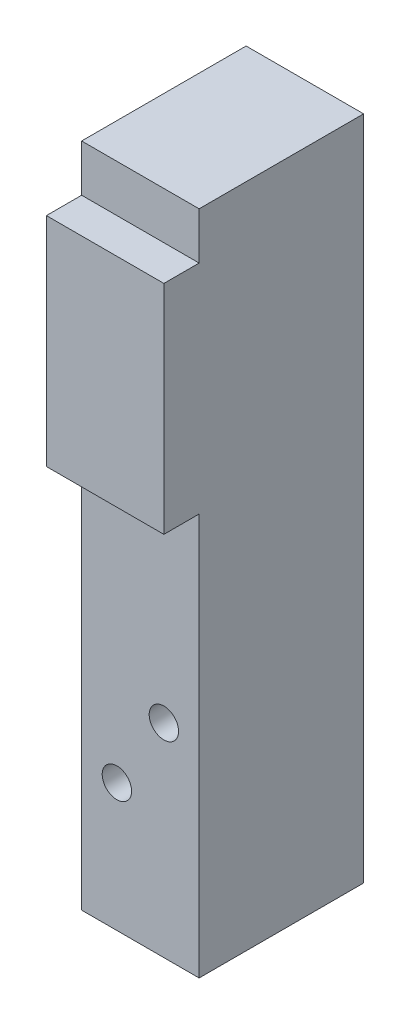
ISO-10303-21;
HEADER;
FILE_DESCRIPTION(('STEP AP214'),'2;1');
FILE_NAME('part.step','',(''),(''),'','','');
FILE_SCHEMA(('AUTOMOTIVE_DESIGN { 1 0 10303 214 1 1 1 1 }'));
ENDSEC;
DATA;
#1=APPLICATION_CONTEXT('core data for automotive mechanical design processes');
#2=APPLICATION_PROTOCOL_DEFINITION('international standard','automotive_design',2000,#1);
#3=PRODUCT_CONTEXT('',#1,'mechanical');
#4=PRODUCT('Part','Part','',(#3));
#5=PRODUCT_RELATED_PRODUCT_CATEGORY('part','',(#4));
#6=PRODUCT_DEFINITION_FORMATION('','',#4);
#7=PRODUCT_DEFINITION_CONTEXT('part definition',#1,'design');
#8=PRODUCT_DEFINITION('design','',#6,#7);
#9=PRODUCT_DEFINITION_SHAPE('','',#8);
#10=(LENGTH_UNIT() NAMED_UNIT(*) SI_UNIT(.MILLI.,.METRE.));
#11=(NAMED_UNIT(*) PLANE_ANGLE_UNIT() SI_UNIT($,.RADIAN.));
#12=(NAMED_UNIT(*) SI_UNIT($,.STERADIAN.) SOLID_ANGLE_UNIT());
#13=UNCERTAINTY_MEASURE_WITH_UNIT(LENGTH_MEASURE(1.E-05),#10,'distance_accuracy_value','');
#14=(GEOMETRIC_REPRESENTATION_CONTEXT(3) GLOBAL_UNCERTAINTY_ASSIGNED_CONTEXT((#13)) GLOBAL_UNIT_ASSIGNED_CONTEXT((#10,
#11,#12)) REPRESENTATION_CONTEXT('',''));
#15=CARTESIAN_POINT('',(0.,0.,0.));
#16=DIRECTION('',(0.,0.,1.));
#17=DIRECTION('',(1.,0.,0.));
#18=AXIS2_PLACEMENT_3D('',#15,#16,#17);
#19=CARTESIAN_POINT('',(-5.,-56.7,7.));
#20=DIRECTION('',(0.,0.,1.));
#21=DIRECTION('',(1.,0.,0.));
#22=AXIS2_PLACEMENT_3D('',#19,#20,#21);
#23=PLANE('',#22);
#24=DIRECTION('',(-1.,0.,0.));
#25=VECTOR('',#24,1.);
#26=CARTESIAN_POINT('',(-5.,-4.,7.));
#27=LINE('',#26,#25);
#28=CARTESIAN_POINT('',(5.,-4.00000000000003,7.));
#29=VERTEX_POINT('',#28);
#30=CARTESIAN_POINT('',(-5.,-4.00000000000003,7.));
#31=VERTEX_POINT('',#30);
#32=EDGE_CURVE('E50',#29,#31,#27,.T.);
#33=ORIENTED_EDGE('',*,*,#32,.F.);
#34=DIRECTION('',(0.,1.,0.));
#35=VECTOR('',#34,1.);
#36=CARTESIAN_POINT('',(5.,-56.7,7.));
#37=LINE('',#36,#35);
#38=CARTESIAN_POINT('',(5.,0.,7.));
#39=VERTEX_POINT('',#38);
#40=EDGE_CURVE('E157',#29,#39,#37,.T.);
#41=ORIENTED_EDGE('',*,*,#40,.T.);
#42=DIRECTION('',(1.,0.,0.));
#43=VECTOR('',#42,1.);
#44=CARTESIAN_POINT('',(-5.,0.,7.));
#45=LINE('',#44,#43);
#46=CARTESIAN_POINT('',(-5.,0.,7.));
#47=VERTEX_POINT('',#46);
#48=EDGE_CURVE('E222',#47,#39,#45,.T.);
#49=ORIENTED_EDGE('',*,*,#48,.F.);
#50=DIRECTION('',(0.,1.,0.));
#51=VECTOR('',#50,1.);
#52=CARTESIAN_POINT('',(-5.,-56.7,7.));
#53=LINE('',#52,#51);
#54=EDGE_CURVE('E55',#31,#47,#53,.T.);
#55=ORIENTED_EDGE('',*,*,#54,.F.);
#56=EDGE_LOOP('',(#33,#41,#49,#55));
#57=FACE_BOUND('',#56,.T.);
#58=ADVANCED_FACE('F33',(#57),#23,.T.);
#59=CARTESIAN_POINT('',(-5.,-56.7,7.));
#60=DIRECTION('',(-1.,0.,0.));
#61=DIRECTION('',(0.,0.,1.));
#62=AXIS2_PLACEMENT_3D('',#59,#60,#61);
#63=PLANE('',#62);
#64=DIRECTION('',(0.,0.,1.));
#65=VECTOR('',#64,1.);
#66=CARTESIAN_POINT('',(-5.,0.,7.));
#67=LINE('',#66,#65);
#68=CARTESIAN_POINT('',(-5.,0.,-7.));
#69=VERTEX_POINT('',#68);
#70=EDGE_CURVE('E169',#69,#47,#67,.T.);
#71=ORIENTED_EDGE('',*,*,#70,.F.);
#72=DIRECTION('',(0.,1.,0.));
#73=VECTOR('',#72,1.);
#74=CARTESIAN_POINT('',(-5.,-56.7,-7.));
#75=LINE('',#74,#73);
#76=CARTESIAN_POINT('',(-5.,-56.7,-7.));
#77=VERTEX_POINT('',#76);
#78=EDGE_CURVE('E11',#77,#69,#75,.T.);
#79=ORIENTED_EDGE('',*,*,#78,.F.);
#80=DIRECTION('',(0.,0.,1.));
#81=VECTOR('',#80,1.);
#82=CARTESIAN_POINT('',(-5.,-56.7,7.));
#83=LINE('',#82,#81);
#84=CARTESIAN_POINT('',(-5.,-56.7,7.));
#85=VERTEX_POINT('',#84);
#86=EDGE_CURVE('E216',#77,#85,#83,.T.);
#87=ORIENTED_EDGE('',*,*,#86,.T.);
#88=CARTESIAN_POINT('',(-5.,-22.498,7.));
#89=VERTEX_POINT('',#88);
#90=EDGE_CURVE('E194',#85,#89,#53,.T.);
#91=ORIENTED_EDGE('',*,*,#90,.T.);
#92=DIRECTION('',(0.,0.,-1.));
#93=VECTOR('',#92,1.);
#94=CARTESIAN_POINT('',(-5.,-22.498,10.));
#95=LINE('',#94,#93);
#96=CARTESIAN_POINT('',(-5.,-22.498,10.));
#97=VERTEX_POINT('',#96);
#98=EDGE_CURVE('E163',#97,#89,#95,.T.);
#99=ORIENTED_EDGE('',*,*,#98,.F.);
#100=DIRECTION('',(0.,-1.,0.));
#101=VECTOR('',#100,1.);
#102=CARTESIAN_POINT('',(-5.,-4.,10.));
#103=LINE('',#102,#101);
#104=CARTESIAN_POINT('',(-5.,-4.,10.));
#105=VERTEX_POINT('',#104);
#106=EDGE_CURVE('E173',#105,#97,#103,.T.);
#107=ORIENTED_EDGE('',*,*,#106,.F.);
#108=DIRECTION('',(0.,0.,-1.));
#109=VECTOR('',#108,1.);
#110=CARTESIAN_POINT('',(-5.,-4.,10.));
#111=LINE('',#110,#109);
#112=EDGE_CURVE('E174',#105,#31,#111,.T.);
#113=ORIENTED_EDGE('',*,*,#112,.T.);
#114=ORIENTED_EDGE('',*,*,#54,.T.);
#115=EDGE_LOOP('',(#71,#79,#87,#91,#99,#107,#113,#114));
#116=FACE_BOUND('',#115,.T.);
#117=ADVANCED_FACE('F35',(#116),#63,.T.);
#118=CARTESIAN_POINT('',(-5.,-56.7,-7.));
#119=DIRECTION('',(0.,0.,-1.));
#120=DIRECTION('',(-1.,0.,0.));
#121=AXIS2_PLACEMENT_3D('',#118,#119,#120);
#122=PLANE('',#121);
#123=CARTESIAN_POINT('',(0.,-36.2,-7.));
#124=DIRECTION('',(0.,0.,-1.));
#125=DIRECTION('',(-1.,0.,0.));
#126=AXIS2_PLACEMENT_3D('',#123,#124,#125);
#127=CIRCLE('',#126,1.25);
#128=CARTESIAN_POINT('',(-1.25,-36.2,-7.));
#129=VERTEX_POINT('',#128);
#130=EDGE_CURVE('E133',#129,#129,#127,.T.);
#131=ORIENTED_EDGE('',*,*,#130,.F.);
#132=EDGE_LOOP('',(#131));
#133=FACE_BOUND('',#132,.T.);
#134=CARTESIAN_POINT('',(0.,-42.6,-7.));
#135=DIRECTION('',(0.,0.,-1.));
#136=DIRECTION('',(-1.,0.,0.));
#137=AXIS2_PLACEMENT_3D('',#134,#135,#136);
#138=CIRCLE('',#137,1.25);
#139=CARTESIAN_POINT('',(-1.25,-42.6,-7.));
#140=VERTEX_POINT('',#139);
#141=EDGE_CURVE('E139',#140,#140,#138,.T.);
#142=ORIENTED_EDGE('',*,*,#141,.F.);
#143=EDGE_LOOP('',(#142));
#144=FACE_BOUND('',#143,.T.);
#145=CARTESIAN_POINT('',(0.,-49.,-7.));
#146=DIRECTION('',(0.,0.,-1.));
#147=DIRECTION('',(-1.,0.,0.));
#148=AXIS2_PLACEMENT_3D('',#145,#146,#147);
#149=CIRCLE('',#148,1.25);
#150=CARTESIAN_POINT('',(-1.25,-49.,-7.));
#151=VERTEX_POINT('',#150);
#152=EDGE_CURVE('E145',#151,#151,#149,.T.);
#153=ORIENTED_EDGE('',*,*,#152,.F.);
#154=EDGE_LOOP('',(#153));
#155=FACE_BOUND('',#154,.T.);
#156=DIRECTION('',(-1.,0.,0.));
#157=VECTOR('',#156,1.);
#158=CARTESIAN_POINT('',(-5.,0.,-7.));
#159=LINE('',#158,#157);
#160=CARTESIAN_POINT('',(5.,0.,-7.));
#161=VERTEX_POINT('',#160);
#162=EDGE_CURVE('E218',#161,#69,#159,.T.);
#163=ORIENTED_EDGE('',*,*,#162,.F.);
#164=DIRECTION('',(0.,1.,0.));
#165=VECTOR('',#164,1.);
#166=CARTESIAN_POINT('',(5.,-56.7,-7.));
#167=LINE('',#166,#165);
#168=CARTESIAN_POINT('',(5.,-56.7,-7.));
#169=VERTEX_POINT('',#168);
#170=EDGE_CURVE('E42',#169,#161,#167,.T.);
#171=ORIENTED_EDGE('',*,*,#170,.F.);
#172=DIRECTION('',(-1.,0.,0.));
#173=VECTOR('',#172,1.);
#174=CARTESIAN_POINT('',(-5.,-56.7,-7.));
#175=LINE('',#174,#173);
#176=EDGE_CURVE('E200',#169,#77,#175,.T.);
#177=ORIENTED_EDGE('',*,*,#176,.T.);
#178=ORIENTED_EDGE('',*,*,#78,.T.);
#179=EDGE_LOOP('',(#163,#171,#177,#178));
#180=FACE_BOUND('',#179,.T.);
#181=ADVANCED_FACE('F255',(#133,#144,#155,#180),#122,.T.);
#182=CARTESIAN_POINT('',(5.,-56.7,7.));
#183=DIRECTION('',(1.,0.,0.));
#184=DIRECTION('',(0.,0.,-1.));
#185=AXIS2_PLACEMENT_3D('',#182,#183,#184);
#186=PLANE('',#185);
#187=DIRECTION('',(0.,0.,-1.));
#188=VECTOR('',#187,1.);
#189=CARTESIAN_POINT('',(5.,0.,7.));
#190=LINE('',#189,#188);
#191=EDGE_CURVE('E191',#39,#161,#190,.T.);
#192=ORIENTED_EDGE('',*,*,#191,.F.);
#193=ORIENTED_EDGE('',*,*,#40,.F.);
#194=DIRECTION('',(0.,0.,-1.));
#195=VECTOR('',#194,1.);
#196=CARTESIAN_POINT('',(5.,-4.,10.));
#197=LINE('',#196,#195);
#198=CARTESIAN_POINT('',(5.,-4.,10.));
#199=VERTEX_POINT('',#198);
#200=EDGE_CURVE('E164',#199,#29,#197,.T.);
#201=ORIENTED_EDGE('',*,*,#200,.F.);
#202=DIRECTION('',(0.,1.,0.));
#203=VECTOR('',#202,1.);
#204=CARTESIAN_POINT('',(5.,-4.,10.));
#205=LINE('',#204,#203);
#206=CARTESIAN_POINT('',(5.,-22.498,10.));
#207=VERTEX_POINT('',#206);
#208=EDGE_CURVE('E189',#207,#199,#205,.T.);
#209=ORIENTED_EDGE('',*,*,#208,.F.);
#210=DIRECTION('',(0.,0.,-1.));
#211=VECTOR('',#210,1.);
#212=CARTESIAN_POINT('',(5.,-22.498,10.));
#213=LINE('',#212,#211);
#214=CARTESIAN_POINT('',(5.,-22.498,7.));
#215=VERTEX_POINT('',#214);
#216=EDGE_CURVE('E160',#207,#215,#213,.T.);
#217=ORIENTED_EDGE('',*,*,#216,.T.);
#218=CARTESIAN_POINT('',(5.,-56.7,7.));
#219=VERTEX_POINT('',#218);
#220=EDGE_CURVE('E193',#219,#215,#37,.T.);
#221=ORIENTED_EDGE('',*,*,#220,.F.);
#222=DIRECTION('',(0.,0.,-1.));
#223=VECTOR('',#222,1.);
#224=CARTESIAN_POINT('',(5.,-56.7,7.));
#225=LINE('',#224,#223);
#226=EDGE_CURVE('E210',#219,#169,#225,.T.);
#227=ORIENTED_EDGE('',*,*,#226,.T.);
#228=ORIENTED_EDGE('',*,*,#170,.T.);
#229=EDGE_LOOP('',(#192,#193,#201,#209,#217,#221,#227,#228));
#230=FACE_BOUND('',#229,.T.);
#231=ADVANCED_FACE('F188',(#230),#186,.T.);
#232=CARTESIAN_POINT('',(2.,-39.4,7.));
#233=DIRECTION('',(0.,0.,1.));
#234=DIRECTION('',(1.,0.,0.));
#235=AXIS2_PLACEMENT_3D('',#232,#233,#234);
#236=CIRCLE('',#235,1.24999999999999);
#237=CARTESIAN_POINT('',(3.24999999999999,-39.4,7.));
#238=VERTEX_POINT('',#237);
#239=EDGE_CURVE('E119',#238,#238,#236,.T.);
#240=ORIENTED_EDGE('',*,*,#239,.F.);
#241=EDGE_LOOP('',(#240));
#242=FACE_BOUND('',#241,.T.);
#243=CARTESIAN_POINT('',(-2.,-45.81,7.));
#244=DIRECTION('',(0.,0.,1.));
#245=DIRECTION('',(1.,0.,0.));
#246=AXIS2_PLACEMENT_3D('',#243,#244,#245);
#247=CIRCLE('',#246,1.24999999999999);
#248=CARTESIAN_POINT('',(-0.750000000000011,-45.81,7.));
#249=VERTEX_POINT('',#248);
#250=EDGE_CURVE('E127',#249,#249,#247,.T.);
#251=ORIENTED_EDGE('',*,*,#250,.F.);
#252=EDGE_LOOP('',(#251));
#253=FACE_BOUND('',#252,.T.);
#254=DIRECTION('',(1.,0.,0.));
#255=VECTOR('',#254,1.);
#256=CARTESIAN_POINT('',(-5.,-22.498,7.));
#257=LINE('',#256,#255);
#258=EDGE_CURVE('E148',#89,#215,#257,.T.);
#259=ORIENTED_EDGE('',*,*,#258,.F.);
#260=ORIENTED_EDGE('',*,*,#90,.F.);
#261=DIRECTION('',(1.,0.,0.));
#262=VECTOR('',#261,1.);
#263=CARTESIAN_POINT('',(-5.,-56.7,7.));
#264=LINE('',#263,#262);
#265=EDGE_CURVE('E213',#85,#219,#264,.T.);
#266=ORIENTED_EDGE('',*,*,#265,.T.);
#267=ORIENTED_EDGE('',*,*,#220,.T.);
#268=EDGE_LOOP('',(#259,#260,#266,#267));
#269=FACE_BOUND('',#268,.T.);
#270=ADVANCED_FACE('F244',(#242,#253,#269),#23,.T.);
#271=CARTESIAN_POINT('',(-5.,-56.7,7.));
#272=DIRECTION('',(0.,-1.,0.));
#273=DIRECTION('',(0.,0.,-1.));
#274=AXIS2_PLACEMENT_3D('',#271,#272,#273);
#275=PLANE('',#274);
#276=ORIENTED_EDGE('',*,*,#86,.F.);
#277=ORIENTED_EDGE('',*,*,#176,.F.);
#278=ORIENTED_EDGE('',*,*,#226,.F.);
#279=ORIENTED_EDGE('',*,*,#265,.F.);
#280=EDGE_LOOP('',(#276,#277,#278,#279));
#281=FACE_BOUND('',#280,.T.);
#282=ADVANCED_FACE('F243',(#281),#275,.T.);
#283=CARTESIAN_POINT('',(-5.,0.,7.));
#284=DIRECTION('',(0.,-1.,0.));
#285=DIRECTION('',(0.,0.,-1.));
#286=AXIS2_PLACEMENT_3D('',#283,#284,#285);
#287=PLANE('',#286);
#288=ORIENTED_EDGE('',*,*,#70,.T.);
#289=ORIENTED_EDGE('',*,*,#48,.T.);
#290=ORIENTED_EDGE('',*,*,#191,.T.);
#291=ORIENTED_EDGE('',*,*,#162,.T.);
#292=EDGE_LOOP('',(#288,#289,#290,#291));
#293=FACE_BOUND('',#292,.T.);
#294=ADVANCED_FACE('F252',(#293),#287,.F.);
#295=CARTESIAN_POINT('',(-5.,-22.498,10.));
#296=DIRECTION('',(0.,1.,0.));
#297=DIRECTION('',(0.,0.,1.));
#298=AXIS2_PLACEMENT_3D('',#295,#296,#297);
#299=PLANE('',#298);
#300=ORIENTED_EDGE('',*,*,#258,.T.);
#301=ORIENTED_EDGE('',*,*,#216,.F.);
#302=DIRECTION('',(1.,0.,0.));
#303=VECTOR('',#302,1.);
#304=CARTESIAN_POINT('',(-5.,-22.498,10.));
#305=LINE('',#304,#303);
#306=EDGE_CURVE('E228',#97,#207,#305,.T.);
#307=ORIENTED_EDGE('',*,*,#306,.F.);
#308=ORIENTED_EDGE('',*,*,#98,.T.);
#309=EDGE_LOOP('',(#300,#301,#307,#308));
#310=FACE_BOUND('',#309,.T.);
#311=ADVANCED_FACE('F236',(#310),#299,.F.);
#312=CARTESIAN_POINT('',(-5.,-4.,10.));
#313=DIRECTION('',(0.,-1.,0.));
#314=DIRECTION('',(1.,0.,0.));
#315=AXIS2_PLACEMENT_3D('',#312,#313,#314);
#316=PLANE('',#315);
#317=ORIENTED_EDGE('',*,*,#32,.T.);
#318=ORIENTED_EDGE('',*,*,#112,.F.);
#319=DIRECTION('',(-1.,0.,0.));
#320=VECTOR('',#319,1.);
#321=CARTESIAN_POINT('',(-5.,-4.,10.));
#322=LINE('',#321,#320);
#323=EDGE_CURVE('E177',#199,#105,#322,.T.);
#324=ORIENTED_EDGE('',*,*,#323,.F.);
#325=ORIENTED_EDGE('',*,*,#200,.T.);
#326=EDGE_LOOP('',(#317,#318,#324,#325));
#327=FACE_BOUND('',#326,.T.);
#328=ADVANCED_FACE('F183',(#327),#316,.F.);
#329=CARTESIAN_POINT('',(-5.,-22.498,10.));
#330=DIRECTION('',(0.,0.,1.));
#331=DIRECTION('',(1.,0.,0.));
#332=AXIS2_PLACEMENT_3D('',#329,#330,#331);
#333=PLANE('',#332);
#334=ORIENTED_EDGE('',*,*,#106,.T.);
#335=ORIENTED_EDGE('',*,*,#306,.T.);
#336=ORIENTED_EDGE('',*,*,#208,.T.);
#337=ORIENTED_EDGE('',*,*,#323,.T.);
#338=EDGE_LOOP('',(#334,#335,#336,#337));
#339=FACE_BOUND('',#338,.T.);
#340=ADVANCED_FACE('F232',(#339),#333,.T.);
#341=CARTESIAN_POINT('',(0.,-49.,-7.));
#342=DIRECTION('',(0.,0.,-1.));
#343=DIRECTION('',(-1.,0.,0.));
#344=AXIS2_PLACEMENT_3D('',#341,#342,#343);
#345=CYLINDRICAL_SURFACE('',#344,1.25);
#346=CARTESIAN_POINT('',(0.,-49.,0.5));
#347=DIRECTION('',(0.,0.,-1.));
#348=DIRECTION('',(-1.,0.,0.));
#349=AXIS2_PLACEMENT_3D('',#346,#347,#348);
#350=CIRCLE('',#349,1.25);
#351=CARTESIAN_POINT('',(-1.25,-49.,0.5));
#352=VERTEX_POINT('',#351);
#353=EDGE_CURVE('E142',#352,#352,#350,.T.);
#354=ORIENTED_EDGE('',*,*,#353,.F.);
#355=EDGE_LOOP('',(#354));
#356=FACE_BOUND('',#355,.T.);
#357=ORIENTED_EDGE('',*,*,#152,.T.);
#358=EDGE_LOOP('',(#357));
#359=FACE_BOUND('',#358,.T.);
#360=ADVANCED_FACE('F283',(#356,#359),#345,.F.);
#361=CARTESIAN_POINT('',(0.,-49.,0.5));
#362=DIRECTION('',(0.,0.,-1.));
#363=DIRECTION('',(-1.,0.,0.));
#364=AXIS2_PLACEMENT_3D('',#361,#362,#363);
#365=CONICAL_SURFACE('',#364,1.25,1.39626340159546);
#366=CARTESIAN_POINT('',(0.,-49.,0.720408725885582));
#367=VERTEX_POINT('',#366);
#368=VERTEX_LOOP('',#367);
#369=FACE_BOUND('',#368,.T.);
#370=ORIENTED_EDGE('',*,*,#353,.T.);
#371=EDGE_LOOP('',(#370));
#372=FACE_BOUND('',#371,.T.);
#373=ADVANCED_FACE('F286',(#369,#372),#365,.F.);
#374=CARTESIAN_POINT('',(0.,-42.6,-7.));
#375=DIRECTION('',(0.,0.,-1.));
#376=DIRECTION('',(-1.,0.,0.));
#377=AXIS2_PLACEMENT_3D('',#374,#375,#376);
#378=CYLINDRICAL_SURFACE('',#377,1.25);
#379=CARTESIAN_POINT('',(0.,-42.6,0.5));
#380=DIRECTION('',(0.,0.,-1.));
#381=DIRECTION('',(-1.,0.,0.));
#382=AXIS2_PLACEMENT_3D('',#379,#380,#381);
#383=CIRCLE('',#382,1.25);
#384=CARTESIAN_POINT('',(-1.25,-42.6,0.5));
#385=VERTEX_POINT('',#384);
#386=EDGE_CURVE('E136',#385,#385,#383,.T.);
#387=ORIENTED_EDGE('',*,*,#386,.F.);
#388=EDGE_LOOP('',(#387));
#389=FACE_BOUND('',#388,.T.);
#390=ORIENTED_EDGE('',*,*,#141,.T.);
#391=EDGE_LOOP('',(#390));
#392=FACE_BOUND('',#391,.T.);
#393=ADVANCED_FACE('F290',(#389,#392),#378,.F.);
#394=CARTESIAN_POINT('',(0.,-42.6,0.5));
#395=DIRECTION('',(0.,0.,-1.));
#396=DIRECTION('',(-1.,0.,0.));
#397=AXIS2_PLACEMENT_3D('',#394,#395,#396);
#398=CONICAL_SURFACE('',#397,1.25,1.39626340159546);
#399=CARTESIAN_POINT('',(0.,-42.6,0.720408725885582));
#400=VERTEX_POINT('',#399);
#401=VERTEX_LOOP('',#400);
#402=FACE_BOUND('',#401,.T.);
#403=ORIENTED_EDGE('',*,*,#386,.T.);
#404=EDGE_LOOP('',(#403));
#405=FACE_BOUND('',#404,.T.);
#406=ADVANCED_FACE('F294',(#402,#405),#398,.F.);
#407=CARTESIAN_POINT('',(0.,-36.2,-7.));
#408=DIRECTION('',(0.,0.,-1.));
#409=DIRECTION('',(-1.,0.,0.));
#410=AXIS2_PLACEMENT_3D('',#407,#408,#409);
#411=CYLINDRICAL_SURFACE('',#410,1.25);
#412=CARTESIAN_POINT('',(0.,-36.2,0.5));
#413=DIRECTION('',(0.,0.,-1.));
#414=DIRECTION('',(-1.,0.,0.));
#415=AXIS2_PLACEMENT_3D('',#412,#413,#414);
#416=CIRCLE('',#415,1.25);
#417=CARTESIAN_POINT('',(-1.25,-36.2,0.5));
#418=VERTEX_POINT('',#417);
#419=EDGE_CURVE('E130',#418,#418,#416,.T.);
#420=ORIENTED_EDGE('',*,*,#419,.F.);
#421=EDGE_LOOP('',(#420));
#422=FACE_BOUND('',#421,.T.);
#423=ORIENTED_EDGE('',*,*,#130,.T.);
#424=EDGE_LOOP('',(#423));
#425=FACE_BOUND('',#424,.T.);
#426=ADVANCED_FACE('F298',(#422,#425),#411,.F.);
#427=CARTESIAN_POINT('',(0.,-36.2,0.5));
#428=DIRECTION('',(0.,0.,-1.));
#429=DIRECTION('',(-1.,0.,0.));
#430=AXIS2_PLACEMENT_3D('',#427,#428,#429);
#431=CONICAL_SURFACE('',#430,1.25,1.39626340159546);
#432=CARTESIAN_POINT('',(0.,-36.2,0.720408725885582));
#433=VERTEX_POINT('',#432);
#434=VERTEX_LOOP('',#433);
#435=FACE_BOUND('',#434,.T.);
#436=ORIENTED_EDGE('',*,*,#419,.T.);
#437=EDGE_LOOP('',(#436));
#438=FACE_BOUND('',#437,.T.);
#439=ADVANCED_FACE('F302',(#435,#438),#431,.F.);
#440=CARTESIAN_POINT('',(-2.,-45.81,7.));
#441=DIRECTION('',(0.,0.,1.));
#442=DIRECTION('',(1.,0.,0.));
#443=AXIS2_PLACEMENT_3D('',#440,#441,#442);
#444=CYLINDRICAL_SURFACE('',#443,1.24999999999999);
#445=CARTESIAN_POINT('',(-2.,-45.81,-0.499999999999993));
#446=DIRECTION('',(0.,0.,1.));
#447=DIRECTION('',(1.,0.,0.));
#448=AXIS2_PLACEMENT_3D('',#445,#446,#447);
#449=CIRCLE('',#448,1.24999999999999);
#450=CARTESIAN_POINT('',(-0.750000000000013,-45.81,-0.499999999999993));
#451=VERTEX_POINT('',#450);
#452=EDGE_CURVE('E122',#451,#451,#449,.T.);
#453=ORIENTED_EDGE('',*,*,#452,.F.);
#454=EDGE_LOOP('',(#453));
#455=FACE_BOUND('',#454,.T.);
#456=ORIENTED_EDGE('',*,*,#250,.T.);
#457=EDGE_LOOP('',(#456));
#458=FACE_BOUND('',#457,.T.);
#459=ADVANCED_FACE('F305',(#455,#458),#444,.F.);
#460=CARTESIAN_POINT('',(-2.,-45.81,-0.499999999999993));
#461=DIRECTION('',(0.,0.,1.));
#462=DIRECTION('',(1.,0.,0.));
#463=AXIS2_PLACEMENT_3D('',#460,#461,#462);
#464=CONICAL_SURFACE('',#463,1.24999999999999,1.39626340159546);
#465=CARTESIAN_POINT('',(-2.,-45.81,-0.72040872588558));
#466=VERTEX_POINT('',#465);
#467=VERTEX_LOOP('',#466);
#468=FACE_BOUND('',#467,.T.);
#469=ORIENTED_EDGE('',*,*,#452,.T.);
#470=EDGE_LOOP('',(#469));
#471=FACE_BOUND('',#470,.T.);
#472=ADVANCED_FACE('F309',(#468,#471),#464,.F.);
#473=CARTESIAN_POINT('',(2.,-39.4,7.));
#474=DIRECTION('',(0.,0.,1.));
#475=DIRECTION('',(1.,0.,0.));
#476=AXIS2_PLACEMENT_3D('',#473,#474,#475);
#477=CYLINDRICAL_SURFACE('',#476,1.24999999999999);
#478=CARTESIAN_POINT('',(2.,-39.4,-0.499999999999993));
#479=DIRECTION('',(0.,0.,1.));
#480=DIRECTION('',(1.,0.,0.));
#481=AXIS2_PLACEMENT_3D('',#478,#479,#480);
#482=CIRCLE('',#481,1.24999999999999);
#483=CARTESIAN_POINT('',(3.24999999999999,-39.4,-0.499999999999993));
#484=VERTEX_POINT('',#483);
#485=EDGE_CURVE('E117',#484,#484,#482,.T.);
#486=ORIENTED_EDGE('',*,*,#485,.F.);
#487=EDGE_LOOP('',(#486));
#488=FACE_BOUND('',#487,.T.);
#489=ORIENTED_EDGE('',*,*,#239,.T.);
#490=EDGE_LOOP('',(#489));
#491=FACE_BOUND('',#490,.T.);
#492=ADVANCED_FACE('F113',(#488,#491),#477,.F.);
#493=CARTESIAN_POINT('',(2.,-39.4,-0.499999999999993));
#494=DIRECTION('',(0.,0.,1.));
#495=DIRECTION('',(1.,0.,0.));
#496=AXIS2_PLACEMENT_3D('',#493,#494,#495);
#497=CONICAL_SURFACE('',#496,1.24999999999999,1.39626340159546);
#498=CARTESIAN_POINT('',(2.,-39.4,-0.72040872588558));
#499=VERTEX_POINT('',#498);
#500=VERTEX_LOOP('',#499);
#501=FACE_BOUND('',#500,.T.);
#502=ORIENTED_EDGE('',*,*,#485,.T.);
#503=EDGE_LOOP('',(#502));
#504=FACE_BOUND('',#503,.T.);
#505=ADVANCED_FACE('F110',(#501,#504),#497,.F.);
#506=CLOSED_SHELL('',(#58,#117,#181,#231,#270,#282,#294,#311,#328,#340,#360,#373,#393,#406,#426,
#439,#459,#472,#492,#505));
#507=MANIFOLD_SOLID_BREP('B2',#506);
#508=ADVANCED_BREP_SHAPE_REPRESENTATION('',(#18,#507),#14);
#509=SHAPE_DEFINITION_REPRESENTATION(#9,#508);
ENDSEC;
END-ISO-10303-21;
